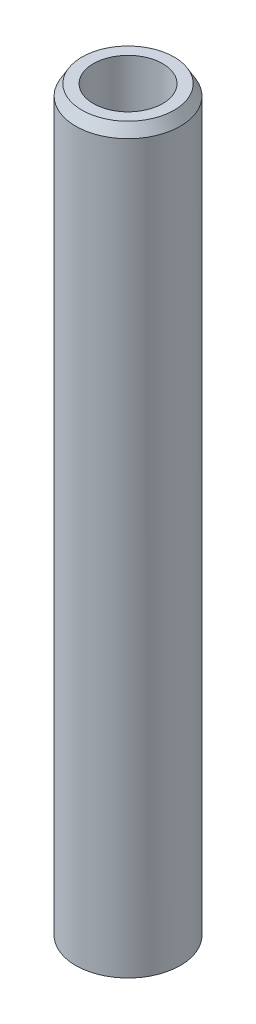
ISO-10303-21;
HEADER;
FILE_DESCRIPTION(('STEP AP214'),'2;1');
FILE_NAME('part.step','',(''),(''),'','','');
FILE_SCHEMA(('AUTOMOTIVE_DESIGN { 1 0 10303 214 1 1 1 1 }'));
ENDSEC;
DATA;
#1=APPLICATION_CONTEXT('core data for automotive mechanical design processes');
#2=APPLICATION_PROTOCOL_DEFINITION('international standard','automotive_design',2000,#1);
#3=PRODUCT_CONTEXT('',#1,'mechanical');
#4=PRODUCT('Part','Part','',(#3));
#5=PRODUCT_RELATED_PRODUCT_CATEGORY('part','',(#4));
#6=PRODUCT_DEFINITION_FORMATION('','',#4);
#7=PRODUCT_DEFINITION_CONTEXT('part definition',#1,'design');
#8=PRODUCT_DEFINITION('design','',#6,#7);
#9=PRODUCT_DEFINITION_SHAPE('','',#8);
#10=(LENGTH_UNIT() NAMED_UNIT(*) SI_UNIT(.MILLI.,.METRE.));
#11=(NAMED_UNIT(*) PLANE_ANGLE_UNIT() SI_UNIT($,.RADIAN.));
#12=(NAMED_UNIT(*) SI_UNIT($,.STERADIAN.) SOLID_ANGLE_UNIT());
#13=UNCERTAINTY_MEASURE_WITH_UNIT(LENGTH_MEASURE(1.E-05),#10,'distance_accuracy_value','');
#14=(GEOMETRIC_REPRESENTATION_CONTEXT(3) GLOBAL_UNCERTAINTY_ASSIGNED_CONTEXT((#13)) GLOBAL_UNIT_ASSIGNED_CONTEXT((#10,
#11,#12)) REPRESENTATION_CONTEXT('',''));
#15=CARTESIAN_POINT('',(0.,0.,0.));
#16=DIRECTION('',(0.,0.,1.));
#17=DIRECTION('',(1.,0.,0.));
#18=AXIS2_PLACEMENT_3D('',#15,#16,#17);
#19=CARTESIAN_POINT('',(0.,391.032983087729,0.));
#20=DIRECTION('',(0.,-1.,0.));
#21=DIRECTION('',(0.,0.,-1.));
#22=AXIS2_PLACEMENT_3D('',#19,#20,#21);
#23=CYLINDRICAL_SURFACE('',#22,27.5);
#24=CARTESIAN_POINT('',(0.,385.377296470003,0.));
#25=DIRECTION('',(0.,1.,0.));
#26=DIRECTION('',(0.,0.,1.));
#27=AXIS2_PLACEMENT_3D('',#24,#25,#26);
#28=CIRCLE('',#27,27.5);
#29=CARTESIAN_POINT('',(0.,385.377296470003,-27.5));
#30=VERTEX_POINT('',#29);
#31=EDGE_CURVE('E50',#30,#30,#28,.F.);
#32=CARTESIAN_POINT('',(0.,3.26531219119652,0.));
#33=DIRECTION('',(0.,1.,0.));
#34=DIRECTION('',(0.,0.,1.));
#35=AXIS2_PLACEMENT_3D('',#32,#33,#34);
#36=CIRCLE('',#35,27.5);
#37=CARTESIAN_POINT('',(0.,3.26531219119652,-27.5));
#38=VERTEX_POINT('',#37);
#39=EDGE_CURVE('E51',#38,#38,#36,.T.);
#40=CARTESIAN_POINT('',(0.,385.377296470003,-27.5));
#41=CARTESIAN_POINT('',(0.,381.396963300432,-27.5));
#42=CARTESIAN_POINT('',(0.,377.416630130861,-27.5));
#43=CARTESIAN_POINT('',(0.,369.455963791719,-27.5));
#44=CARTESIAN_POINT('',(0.,365.475630622148,-27.5));
#45=CARTESIAN_POINT('',(0.,357.514964283006,-27.5));
#46=CARTESIAN_POINT('',(0.,353.534631113435,-27.5));
#47=CARTESIAN_POINT('',(0.,345.573964774294,-27.5));
#48=CARTESIAN_POINT('',(0.,341.593631604723,-27.5));
#49=CARTESIAN_POINT('',(0.,333.632965265581,-27.5));
#50=CARTESIAN_POINT('',(0.,329.65263209601,-27.5));
#51=CARTESIAN_POINT('',(0.,321.691965756868,-27.5));
#52=CARTESIAN_POINT('',(0.,317.711632587297,-27.5));
#53=CARTESIAN_POINT('',(0.,309.750966248156,-27.5));
#54=CARTESIAN_POINT('',(0.,305.770633078585,-27.5));
#55=CARTESIAN_POINT('',(0.,297.809966739443,-27.5));
#56=CARTESIAN_POINT('',(0.,293.829633569872,-27.5));
#57=CARTESIAN_POINT('',(0.,285.86896723073,-27.5));
#58=CARTESIAN_POINT('',(0.,281.888634061159,-27.5));
#59=CARTESIAN_POINT('',(0.,273.927967722018,-27.5));
#60=CARTESIAN_POINT('',(0.,269.947634552447,-27.5));
#61=CARTESIAN_POINT('',(0.,261.986968213305,-27.5));
#62=CARTESIAN_POINT('',(0.,258.006635043734,-27.5));
#63=CARTESIAN_POINT('',(0.,250.045968704592,-27.5));
#64=CARTESIAN_POINT('',(0.,246.065635535021,-27.5));
#65=CARTESIAN_POINT('',(0.,238.104969195879,-27.5));
#66=CARTESIAN_POINT('',(0.,234.124636026309,-27.5));
#67=CARTESIAN_POINT('',(0.,226.163969687167,-27.5));
#68=CARTESIAN_POINT('',(0.,222.183636517596,-27.5));
#69=CARTESIAN_POINT('',(0.,214.222970178454,-27.5));
#70=CARTESIAN_POINT('',(0.,210.242637008883,-27.5));
#71=CARTESIAN_POINT('',(0.,202.281970669741,-27.5));
#72=CARTESIAN_POINT('',(0.,198.30163750017,-27.5));
#73=CARTESIAN_POINT('',(0.,190.340971161029,-27.5));
#74=CARTESIAN_POINT('',(0.,186.360637991458,-27.5));
#75=CARTESIAN_POINT('',(0.,178.399971652316,-27.5));
#76=CARTESIAN_POINT('',(0.,174.419638482745,-27.5));
#77=CARTESIAN_POINT('',(0.,166.458972143603,-27.5));
#78=CARTESIAN_POINT('',(0.,162.478638974032,-27.5));
#79=CARTESIAN_POINT('',(0.,154.517972634891,-27.5));
#80=CARTESIAN_POINT('',(0.,150.53763946532,-27.5));
#81=CARTESIAN_POINT('',(0.,142.576973126178,-27.5));
#82=CARTESIAN_POINT('',(0.,138.596639956607,-27.5));
#83=CARTESIAN_POINT('',(0.,130.635973617465,-27.5));
#84=CARTESIAN_POINT('',(0.,126.655640447894,-27.5));
#85=CARTESIAN_POINT('',(0.,118.694974108753,-27.5));
#86=CARTESIAN_POINT('',(0.,114.714640939182,-27.5));
#87=CARTESIAN_POINT('',(0.,106.75397460004,-27.5));
#88=CARTESIAN_POINT('',(0.,102.773641430469,-27.5));
#89=CARTESIAN_POINT('',(0.,94.8129750913271,-27.5));
#90=CARTESIAN_POINT('',(0.,90.8326419217563,-27.5));
#91=CARTESIAN_POINT('',(0.,82.8719755826145,-27.5));
#92=CARTESIAN_POINT('',(0.,78.8916424130436,-27.5));
#93=CARTESIAN_POINT('',(0.,70.9309760739018,-27.5));
#94=CARTESIAN_POINT('',(0.,66.9506429043309,-27.5));
#95=CARTESIAN_POINT('',(0.,58.9899765651891,-27.5));
#96=CARTESIAN_POINT('',(0.,55.0096433956182,-27.5));
#97=CARTESIAN_POINT('',(0.,47.0489770564764,-27.5));
#98=CARTESIAN_POINT('',(0.,43.0686438869055,-27.5));
#99=CARTESIAN_POINT('',(0.,35.1079775477637,-27.5));
#100=CARTESIAN_POINT('',(0.,31.1276443781928,-27.5));
#101=CARTESIAN_POINT('',(0.,23.166978039051,-27.5));
#102=CARTESIAN_POINT('',(0.,19.1866448694801,-27.5));
#103=CARTESIAN_POINT('',(0.,11.2259785303383,-27.5));
#104=CARTESIAN_POINT('',(0.,7.24564536076742,-27.5));
#105=CARTESIAN_POINT('',(0.,3.26531219119652,-27.5));
#106=B_SPLINE_CURVE_WITH_KNOTS('',3,(#40,#41,#42,#43,#44,#45,#46,#47,#48,#49,#50,#51,#52,#53,
#54,#55,#56,#57,#58,#59,#60,#61,#62,#63,#64,#65,#66,#67,#68,#69,#70,#71,#72,#73,#74,#75,#76,#77,
#78,#79,#80,#81,#82,#83,#84,#85,#86,#87,#88,#89,#90,#91,#92,#93,#94,#95,#96,#97,#98,#99,#100,
#101,#102,#103,#104,#105),.UNSPECIFIED.,.F.,.F.,(4,2,2,2,2,2,2,2,2,2,2,2,2,2,2,2,2,2,2,2,2,2,2,
2,2,2,2,2,2,2,2,2,4),(0.,11.9409995087126,23.8819990174253,35.822998526138,47.7639980348507,
59.7049975435634,71.6459970522761,83.5869965609888,95.5279960697015,107.468995578414,
119.409995087127,131.35099459584,143.291994104552,155.232993613265,167.173993121978,
179.11499263069,191.055992139403,202.996991648116,214.937991156828,226.878990665541,
238.819990174254,250.760989682966,262.701989191679,274.642988700392,286.583988209105,
298.524987717817,310.46598722653,322.406986735243,334.347986243955,346.288985752668,
358.229985261381,370.170984770093,382.111984278806),.UNSPECIFIED.);
#107=EDGE_CURVE('BSEAM39',#30,#38,#106,.T.);
#108=ORIENTED_EDGE('',*,*,#31,.T.);
#109=ORIENTED_EDGE('',*,*,#39,.T.);
#110=ORIENTED_EDGE('',*,*,#107,.T.);
#111=ORIENTED_EDGE('',*,*,#107,.F.);
#112=EDGE_LOOP('',(#108,#110,#109,#111));
#113=FACE_BOUND('',#112,.T.);
#114=ADVANCED_FACE('F39',(#113),#23,.T.);
#115=CARTESIAN_POINT('',(0.,391.032983087729,0.));
#116=DIRECTION('',(0.,1.,0.));
#117=DIRECTION('',(0.,0.,1.));
#118=AXIS2_PLACEMENT_3D('',#115,#116,#117);
#119=PLANE('',#118);
#120=CARTESIAN_POINT('',(0.,391.032983087729,0.));
#121=DIRECTION('',(0.,1.,0.));
#122=DIRECTION('',(0.,0.,1.));
#123=AXIS2_PLACEMENT_3D('',#120,#121,#122);
#124=CIRCLE('',#123,24.2346878088037);
#125=CARTESIAN_POINT('',(0.,391.032983087729,-24.2346878088038));
#126=VERTEX_POINT('',#125);
#127=EDGE_CURVE('E54',#126,#126,#124,.T.);
#128=ORIENTED_EDGE('',*,*,#127,.T.);
#129=EDGE_LOOP('',(#128));
#130=FACE_BOUND('',#129,.T.);
#131=CARTESIAN_POINT('',(0.,391.032983087729,0.));
#132=DIRECTION('',(0.,1.,0.));
#133=DIRECTION('',(0.,0.,1.));
#134=AXIS2_PLACEMENT_3D('',#131,#132,#133);
#135=CIRCLE('',#134,18.2114427745079);
#136=CARTESIAN_POINT('',(0.,391.032983087729,-18.2114427745079));
#137=VERTEX_POINT('',#136);
#138=EDGE_CURVE('E58',#137,#137,#135,.T.);
#139=ORIENTED_EDGE('',*,*,#138,.F.);
#140=EDGE_LOOP('',(#139));
#141=FACE_BOUND('',#140,.T.);
#142=ADVANCED_FACE('F69',(#130,#141),#119,.T.);
#143=CARTESIAN_POINT('',(0.,0.,0.));
#144=DIRECTION('',(0.,1.,0.));
#145=DIRECTION('',(0.,0.,1.));
#146=AXIS2_PLACEMENT_3D('',#143,#144,#145);
#147=PLANE('',#146);
#148=CARTESIAN_POINT('',(0.,0.,0.));
#149=DIRECTION('',(0.,1.,0.));
#150=DIRECTION('',(0.,0.,1.));
#151=AXIS2_PLACEMENT_3D('',#148,#149,#150);
#152=CIRCLE('',#151,21.8443133822735);
#153=CARTESIAN_POINT('',(0.,0.,21.8443133822735));
#154=VERTEX_POINT('',#153);
#155=EDGE_CURVE('E10',#154,#154,#152,.F.);
#156=ORIENTED_EDGE('',*,*,#155,.T.);
#157=EDGE_LOOP('',(#156));
#158=FACE_BOUND('',#157,.T.);
#159=CARTESIAN_POINT('',(0.,0.,0.));
#160=DIRECTION('',(0.,1.,0.));
#161=DIRECTION('',(0.,0.,1.));
#162=AXIS2_PLACEMENT_3D('',#159,#160,#161);
#163=CIRCLE('',#162,18.2114427745079);
#164=CARTESIAN_POINT('',(0.,0.,-18.2114427745079));
#165=VERTEX_POINT('',#164);
#166=EDGE_CURVE('E63',#165,#165,#163,.T.);
#167=ORIENTED_EDGE('',*,*,#166,.T.);
#168=EDGE_LOOP('',(#167));
#169=FACE_BOUND('',#168,.T.);
#170=ADVANCED_FACE('F75',(#158,#169),#147,.F.);
#171=CARTESIAN_POINT('',(0.,391.032983087729,0.));
#172=DIRECTION('',(0.,-1.,0.));
#173=DIRECTION('',(0.,0.,-1.));
#174=AXIS2_PLACEMENT_3D('',#171,#172,#173);
#175=CYLINDRICAL_SURFACE('',#174,18.2114427745079);
#176=CARTESIAN_POINT('',(0.,391.032983087729,-18.2114427745079));
#177=CARTESIAN_POINT('',(0.,386.959722847231,-18.2114427745079));
#178=CARTESIAN_POINT('',(0.,382.886462606734,-18.2114427745079));
#179=CARTESIAN_POINT('',(0.,374.73994212574,-18.2114427745079));
#180=CARTESIAN_POINT('',(0.,370.666681885243,-18.2114427745079));
#181=CARTESIAN_POINT('',(0.,362.520161404248,-18.2114427745079));
#182=CARTESIAN_POINT('',(0.,358.446901163751,-18.2114427745079));
#183=CARTESIAN_POINT('',(0.,350.300380682757,-18.2114427745079));
#184=CARTESIAN_POINT('',(0.,346.22712044226,-18.2114427745079));
#185=CARTESIAN_POINT('',(0.,338.080599961265,-18.2114427745079));
#186=CARTESIAN_POINT('',(0.,334.007339720768,-18.2114427745079));
#187=CARTESIAN_POINT('',(0.,325.860819239774,-18.2114427745079));
#188=CARTESIAN_POINT('',(0.,321.787558999277,-18.2114427745079));
#189=CARTESIAN_POINT('',(0.,313.641038518282,-18.2114427745079));
#190=CARTESIAN_POINT('',(0.,309.567778277785,-18.2114427745079));
#191=CARTESIAN_POINT('',(0.,301.421257796791,-18.2114427745079));
#192=CARTESIAN_POINT('',(0.,297.347997556294,-18.2114427745079));
#193=CARTESIAN_POINT('',(0.,289.201477075299,-18.2114427745079));
#194=CARTESIAN_POINT('',(0.,285.128216834802,-18.2114427745079));
#195=CARTESIAN_POINT('',(0.,276.981696353808,-18.2114427745079));
#196=CARTESIAN_POINT('',(0.,272.908436113311,-18.2114427745079));
#197=CARTESIAN_POINT('',(0.,264.761915632316,-18.2114427745079));
#198=CARTESIAN_POINT('',(0.,260.688655391819,-18.2114427745079));
#199=CARTESIAN_POINT('',(0.,252.542134910825,-18.2114427745079));
#200=CARTESIAN_POINT('',(0.,248.468874670328,-18.2114427745079));
#201=CARTESIAN_POINT('',(0.,240.322354189333,-18.2114427745079));
#202=CARTESIAN_POINT('',(0.,236.249093948836,-18.2114427745079));
#203=CARTESIAN_POINT('',(0.,228.102573467842,-18.2114427745079));
#204=CARTESIAN_POINT('',(0.,224.029313227345,-18.2114427745079));
#205=CARTESIAN_POINT('',(0.,215.88279274635,-18.2114427745079));
#206=CARTESIAN_POINT('',(0.,211.809532505853,-18.2114427745079));
#207=CARTESIAN_POINT('',(0.,203.663012024859,-18.2114427745079));
#208=CARTESIAN_POINT('',(0.,199.589751784362,-18.2114427745079));
#209=CARTESIAN_POINT('',(0.,191.443231303367,-18.2114427745079));
#210=CARTESIAN_POINT('',(0.,187.36997106287,-18.2114427745079));
#211=CARTESIAN_POINT('',(0.,179.223450581876,-18.2114427745079));
#212=CARTESIAN_POINT('',(0.,175.150190341378,-18.2114427745079));
#213=CARTESIAN_POINT('',(0.,167.003669860384,-18.2114427745079));
#214=CARTESIAN_POINT('',(0.,162.930409619887,-18.2114427745079));
#215=CARTESIAN_POINT('',(0.,154.783889138893,-18.2114427745079));
#216=CARTESIAN_POINT('',(0.,150.710628898395,-18.2114427745079));
#217=CARTESIAN_POINT('',(0.,142.564108417401,-18.2114427745079));
#218=CARTESIAN_POINT('',(0.,138.490848176904,-18.2114427745079));
#219=CARTESIAN_POINT('',(0.,130.34432769591,-18.2114427745079));
#220=CARTESIAN_POINT('',(0.,126.271067455412,-18.2114427745079));
#221=CARTESIAN_POINT('',(0.,118.124546974418,-18.2114427745079));
#222=CARTESIAN_POINT('',(0.,114.051286733921,-18.2114427745079));
#223=CARTESIAN_POINT('',(0.,105.904766252927,-18.2114427745079));
#224=CARTESIAN_POINT('',(0.,101.831506012429,-18.2114427745079));
#225=CARTESIAN_POINT('',(0.,93.684985531435,-18.2114427745079));
#226=CARTESIAN_POINT('',(0.,89.6117252909378,-18.2114427745079));
#227=CARTESIAN_POINT('',(0.,81.4652048099435,-18.2114427745079));
#228=CARTESIAN_POINT('',(0.,77.3919445694463,-18.2114427745079));
#229=CARTESIAN_POINT('',(0.,69.245424088452,-18.2114427745079));
#230=CARTESIAN_POINT('',(0.,65.1721638479548,-18.2114427745079));
#231=CARTESIAN_POINT('',(0.,57.0256433669604,-18.2114427745079));
#232=CARTESIAN_POINT('',(0.,52.9523831264633,-18.2114427745079));
#233=CARTESIAN_POINT('',(0.,44.8058626454689,-18.2114427745079));
#234=CARTESIAN_POINT('',(0.,40.7326024049718,-18.2114427745079));
#235=CARTESIAN_POINT('',(0.,32.5860819239774,-18.2114427745079));
#236=CARTESIAN_POINT('',(0.,28.5128216834802,-18.2114427745079));
#237=CARTESIAN_POINT('',(0.,20.3663012024859,-18.2114427745079));
#238=CARTESIAN_POINT('',(0.,16.2930409619887,-18.2114427745079));
#239=CARTESIAN_POINT('',(0.,8.14652048099436,-18.2114427745079));
#240=CARTESIAN_POINT('',(0.,4.07326024049718,-18.2114427745079));
#241=CARTESIAN_POINT('',(0.,0.,-18.2114427745079));
#242=B_SPLINE_CURVE_WITH_KNOTS('',3,(#176,#177,#178,#179,#180,#181,#182,#183,#184,#185,#186,
#187,#188,#189,#190,#191,#192,#193,#194,#195,#196,#197,#198,#199,#200,#201,#202,#203,#204,#205,
#206,#207,#208,#209,#210,#211,#212,#213,#214,#215,#216,#217,#218,#219,#220,#221,#222,#223,#224,
#225,#226,#227,#228,#229,#230,#231,#232,#233,#234,#235,#236,#237,#238,#239,#240,#241),
.UNSPECIFIED.,.F.,.F.,(4,2,2,2,2,2,2,2,2,2,2,2,2,2,2,2,2,2,2,2,2,2,2,2,2,2,2,2,2,2,2,2,4),(0.,
12.2197807214915,24.439561442983,36.6593421644745,48.8791228859661,61.0989036074576,
73.3186843289491,85.5384650504406,97.7582457719322,109.978026493424,122.197807214915,
134.417587936407,146.637368657898,158.85714937939,171.076930100881,183.296710822373,
195.516491543864,207.736272265356,219.956052986847,232.175833708339,244.39561442983,
256.615395151322,268.835175872813,281.054956594305,293.274737315796,305.494518037288,
317.714298758779,329.934079480271,342.153860201763,354.373640923254,366.593421644746,
378.813202366237,391.032983087729),.UNSPECIFIED.);
#243=EDGE_CURVE('BSEAM70',#137,#165,#242,.T.);
#244=ORIENTED_EDGE('',*,*,#138,.T.);
#245=ORIENTED_EDGE('',*,*,#166,.F.);
#246=ORIENTED_EDGE('',*,*,#243,.T.);
#247=ORIENTED_EDGE('',*,*,#243,.F.);
#248=EDGE_LOOP('',(#244,#246,#245,#247));
#249=FACE_BOUND('',#248,.T.);
#250=ADVANCED_FACE('F70',(#249),#175,.F.);
#251=CARTESIAN_POINT('',(0.,391.032983087729,0.));
#252=DIRECTION('',(0.,-1.,0.));
#253=DIRECTION('',(0.,0.,-1.));
#254=AXIS2_PLACEMENT_3D('',#251,#252,#253);
#255=CONICAL_SURFACE('',#254,24.2346878088037,0.523598775598295);
#256=CARTESIAN_POINT('',(0.,385.377296470003,-27.5));
#257=CARTESIAN_POINT('',(0.,385.436209872271,-27.4659863313417));
#258=CARTESIAN_POINT('',(0.,385.495123274539,-27.4319726626834));
#259=CARTESIAN_POINT('',(0.,385.612950079075,-27.3639453253668));
#260=CARTESIAN_POINT('',(0.,385.671863481342,-27.3299316567085));
#261=CARTESIAN_POINT('',(0.,385.789690285878,-27.261904319392));
#262=CARTESIAN_POINT('',(0.,385.848603688146,-27.2278906507337));
#263=CARTESIAN_POINT('',(0.,385.966430492682,-27.1598633134171));
#264=CARTESIAN_POINT('',(0.,386.02534389495,-27.1258496447588));
#265=CARTESIAN_POINT('',(0.,386.143170699486,-27.0578223074422));
#266=CARTESIAN_POINT('',(0.,386.202084101754,-27.0238086387839));
#267=CARTESIAN_POINT('',(0.,386.31991090629,-26.9557813014673));
#268=CARTESIAN_POINT('',(0.,386.378824308558,-26.921767632809));
#269=CARTESIAN_POINT('',(0.,386.496651113094,-26.8537402954924));
#270=CARTESIAN_POINT('',(0.,386.555564515362,-26.8197266268341));
#271=CARTESIAN_POINT('',(0.,386.673391319898,-26.7516992895175));
#272=CARTESIAN_POINT('',(0.,386.732304722166,-26.7176856208593));
#273=CARTESIAN_POINT('',(0.,386.850131526702,-26.6496582835427));
#274=CARTESIAN_POINT('',(0.,386.90904492897,-26.6156446148844));
#275=CARTESIAN_POINT('',(0.,387.026871733506,-26.5476172775678));
#276=CARTESIAN_POINT('',(0.,387.085785135774,-26.5136036089095));
#277=CARTESIAN_POINT('',(0.,387.20361194031,-26.4455762715929));
#278=CARTESIAN_POINT('',(0.,387.262525342578,-26.4115626029346));
#279=CARTESIAN_POINT('',(0.,387.380352147114,-26.343535265618));
#280=CARTESIAN_POINT('',(0.,387.439265549382,-26.3095215969597));
#281=CARTESIAN_POINT('',(0.,387.557092353918,-26.2414942596431));
#282=CARTESIAN_POINT('',(0.,387.616005756186,-26.2074805909848));
#283=CARTESIAN_POINT('',(0.,387.733832560722,-26.1394532536683));
#284=CARTESIAN_POINT('',(0.,387.79274596299,-26.1054395850099));
#285=CARTESIAN_POINT('',(0.,387.910572767526,-26.0374122476934));
#286=CARTESIAN_POINT('',(0.,387.969486169794,-26.0033985790351));
#287=CARTESIAN_POINT('',(0.,388.08731297433,-25.9353712417185));
#288=CARTESIAN_POINT('',(0.,388.146226376598,-25.9013575730602));
#289=CARTESIAN_POINT('',(0.,388.264053181134,-25.8333302357436));
#290=CARTESIAN_POINT('',(0.,388.322966583402,-25.7993165670853));
#291=CARTESIAN_POINT('',(0.,388.440793387938,-25.7312892297687));
#292=CARTESIAN_POINT('',(0.,388.499706790205,-25.6972755611104));
#293=CARTESIAN_POINT('',(0.,388.617533594741,-25.6292482237938));
#294=CARTESIAN_POINT('',(0.,388.676446997009,-25.5952345551355));
#295=CARTESIAN_POINT('',(0.,388.794273801545,-25.5272072178189));
#296=CARTESIAN_POINT('',(0.,388.853187203813,-25.4931935491607));
#297=CARTESIAN_POINT('',(0.,388.971014008349,-25.4251662118441));
#298=CARTESIAN_POINT('',(0.,389.029927410617,-25.3911525431858));
#299=CARTESIAN_POINT('',(0.,389.147754215153,-25.3231252058692));
#300=CARTESIAN_POINT('',(0.,389.206667617421,-25.2891115372109));
#301=CARTESIAN_POINT('',(0.,389.324494421957,-25.2210841998943));
#302=CARTESIAN_POINT('',(0.,389.383407824225,-25.187070531236));
#303=CARTESIAN_POINT('',(0.,389.501234628761,-25.1190431939194));
#304=CARTESIAN_POINT('',(0.,389.560148031029,-25.0850295252611));
#305=CARTESIAN_POINT('',(0.,389.677974835565,-25.0170021879445));
#306=CARTESIAN_POINT('',(0.,389.736888237833,-24.9829885192862));
#307=CARTESIAN_POINT('',(0.,389.854715042369,-24.9149611819697));
#308=CARTESIAN_POINT('',(0.,389.913628444637,-24.8809475133114));
#309=CARTESIAN_POINT('',(0.,390.031455249173,-24.8129201759948));
#310=CARTESIAN_POINT('',(0.,390.090368651441,-24.7789065073365));
#311=CARTESIAN_POINT('',(0.,390.208195455977,-24.7108791700199));
#312=CARTESIAN_POINT('',(0.,390.267108858245,-24.6768655013616));
#313=CARTESIAN_POINT('',(0.,390.384935662781,-24.608838164045));
#314=CARTESIAN_POINT('',(0.,390.443849065049,-24.5748244953867));
#315=CARTESIAN_POINT('',(0.,390.561675869585,-24.5067971580701));
#316=CARTESIAN_POINT('',(0.,390.620589271853,-24.4727834894118));
#317=CARTESIAN_POINT('',(0.,390.738416076389,-24.4047561520952));
#318=CARTESIAN_POINT('',(0.,390.797329478657,-24.3707424834369));
#319=CARTESIAN_POINT('',(0.,390.915156283193,-24.3027151461203));
#320=CARTESIAN_POINT('',(0.,390.974069685461,-24.268701477462));
#321=CARTESIAN_POINT('',(0.,391.032983087729,-24.2346878088038));
#322=B_SPLINE_CURVE_WITH_KNOTS('',3,(#256,#257,#258,#259,#260,#261,#262,#263,#264,#265,#266,
#267,#268,#269,#270,#271,#272,#273,#274,#275,#276,#277,#278,#279,#280,#281,#282,#283,#284,#285,
#286,#287,#288,#289,#290,#291,#292,#293,#294,#295,#296,#297,#298,#299,#300,#301,#302,#303,#304,
#305,#306,#307,#308,#309,#310,#311,#312,#313,#314,#315,#316,#317,#318,#319,#320,#321),
.UNSPECIFIED.,.F.,.F.,(4,2,2,2,2,2,2,2,2,2,2,2,2,2,2,2,2,2,2,2,2,2,2,2,2,2,2,2,2,2,2,2,4),(0.,
0.204082011949797,0.408164023899544,0.61224603584934,0.816328047799089,1.02041005974888,
1.22449207169863,1.42857408364838,1.63265609559818,1.83673810754792,2.04082011949772,
2.24490213144747,2.44898414339722,2.65306615534701,2.85714816729676,3.06123017924656,
3.2653121911963,3.46939420314605,3.67347621509585,3.8775582270456,4.08164023899539,
4.28572225094514,4.48980426289489,4.69388627484468,4.89796828679443,5.10205029874423,
5.30613231069398,5.51021432264372,5.71429633459352,5.91837834654327,6.12246035849306,
6.32654237044281,6.53062438239261),.UNSPECIFIED.);
#323=EDGE_CURVE('BSEAM81',#30,#126,#322,.T.);
#324=ORIENTED_EDGE('',*,*,#31,.F.);
#325=ORIENTED_EDGE('',*,*,#127,.F.);
#326=ORIENTED_EDGE('',*,*,#323,.T.);
#327=ORIENTED_EDGE('',*,*,#323,.F.);
#328=EDGE_LOOP('',(#324,#326,#325,#327));
#329=FACE_BOUND('',#328,.T.);
#330=ADVANCED_FACE('F81',(#329),#255,.T.);
#331=CARTESIAN_POINT('',(0.,3.26531219119652,0.));
#332=DIRECTION('',(0.,1.,0.));
#333=DIRECTION('',(0.,0.,1.));
#334=AXIS2_PLACEMENT_3D('',#331,#332,#333);
#335=CONICAL_SURFACE('',#334,27.5,1.0471975511966);
#336=ORIENTED_EDGE('',*,*,#155,.F.);
#337=EDGE_LOOP('',(#336));
#338=FACE_BOUND('',#337,.T.);
#339=ORIENTED_EDGE('',*,*,#39,.F.);
#340=EDGE_LOOP('',(#339));
#341=FACE_BOUND('',#340,.T.);
#342=ADVANCED_FACE('F45',(#338,#341),#335,.T.);
#343=CLOSED_SHELL('',(#114,#142,#170,#250,#330,#342));
#344=MANIFOLD_SOLID_BREP('B2',#343);
#345=ADVANCED_BREP_SHAPE_REPRESENTATION('',(#18,#344),#14);
#346=SHAPE_DEFINITION_REPRESENTATION(#9,#345);
ENDSEC;
END-ISO-10303-21;
